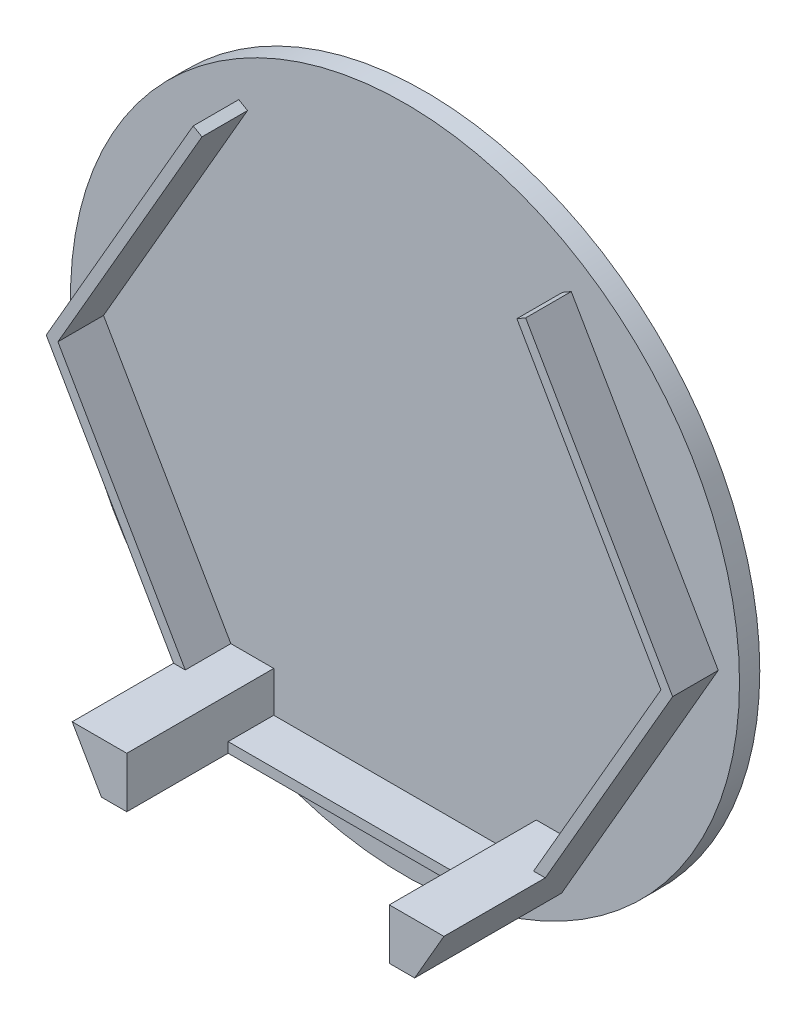
ISO-10303-21;
HEADER;
FILE_DESCRIPTION(('STEP AP214'),'2;1');
FILE_NAME('part.step','',(''),(''),'','','');
FILE_SCHEMA(('AUTOMOTIVE_DESIGN { 1 0 10303 214 1 1 1 1 }'));
ENDSEC;
DATA;
#1=APPLICATION_CONTEXT('core data for automotive mechanical design processes');
#2=APPLICATION_PROTOCOL_DEFINITION('international standard','automotive_design',2000,#1);
#3=PRODUCT_CONTEXT('',#1,'mechanical');
#4=PRODUCT('Part','Part','',(#3));
#5=PRODUCT_RELATED_PRODUCT_CATEGORY('part','',(#4));
#6=PRODUCT_DEFINITION_FORMATION('','',#4);
#7=PRODUCT_DEFINITION_CONTEXT('part definition',#1,'design');
#8=PRODUCT_DEFINITION('design','',#6,#7);
#9=PRODUCT_DEFINITION_SHAPE('','',#8);
#10=(LENGTH_UNIT() NAMED_UNIT(*) SI_UNIT(.MILLI.,.METRE.));
#11=(NAMED_UNIT(*) PLANE_ANGLE_UNIT() SI_UNIT($,.RADIAN.));
#12=(NAMED_UNIT(*) SI_UNIT($,.STERADIAN.) SOLID_ANGLE_UNIT());
#13=UNCERTAINTY_MEASURE_WITH_UNIT(LENGTH_MEASURE(1.E-05),#10,'distance_accuracy_value','');
#14=(GEOMETRIC_REPRESENTATION_CONTEXT(3) GLOBAL_UNCERTAINTY_ASSIGNED_CONTEXT((#13)) GLOBAL_UNIT_ASSIGNED_CONTEXT((#10,
#11,#12)) REPRESENTATION_CONTEXT('',''));
#15=CARTESIAN_POINT('',(0.,0.,0.));
#16=DIRECTION('',(0.,0.,1.));
#17=DIRECTION('',(1.,0.,0.));
#18=AXIS2_PLACEMENT_3D('',#15,#16,#17);
#19=CARTESIAN_POINT('',(0.,0.,6.5));
#20=DIRECTION('',(0.,0.,1.));
#21=DIRECTION('',(1.,0.,0.));
#22=AXIS2_PLACEMENT_3D('',#19,#20,#21);
#23=PLANE('',#22);
#24=DIRECTION('',(-0.5,-0.866025403784439,0.));
#25=VECTOR('',#24,1.);
#26=CARTESIAN_POINT('',(17.1820508075689,-21.7601849769392,6.5));
#27=LINE('',#26,#25);
#28=CARTESIAN_POINT('',(29.7452994616207,0.,6.5));
#29=VERTEX_POINT('',#28);
#30=CARTESIAN_POINT('',(17.1820508075689,-21.7601849769392,6.5));
#31=VERTEX_POINT('',#30);
#32=EDGE_CURVE('E234',#29,#31,#27,.T.);
#33=ORIENTED_EDGE('',*,*,#32,.T.);
#34=DIRECTION('',(-1.,0.,0.));
#35=VECTOR('',#34,1.);
#36=CARTESIAN_POINT('',(18.3367513459481,-21.7601849769392,6.5));
#37=LINE('',#36,#35);
#38=CARTESIAN_POINT('',(18.3367513459481,-21.7601849769392,6.5));
#39=VERTEX_POINT('',#38);
#40=EDGE_CURVE('E200',#39,#31,#37,.T.);
#41=ORIENTED_EDGE('',*,*,#40,.F.);
#42=DIRECTION('',(0.5,0.866025403784439,0.));
#43=VECTOR('',#42,1.);
#44=CARTESIAN_POINT('',(15.45,-26.7601849769392,6.5));
#45=LINE('',#44,#43);
#46=CARTESIAN_POINT('',(30.9,0.,6.5));
#47=VERTEX_POINT('',#46);
#48=EDGE_CURVE('E249',#39,#47,#45,.T.);
#49=ORIENTED_EDGE('',*,*,#48,.T.);
#50=DIRECTION('',(-0.5,0.866025403784439,0.));
#51=VECTOR('',#50,1.);
#52=CARTESIAN_POINT('',(30.9,0.,6.5));
#53=LINE('',#52,#51);
#54=CARTESIAN_POINT('',(16.4,25.1147367097487,6.5));
#55=VERTEX_POINT('',#54);
#56=EDGE_CURVE('E251',#47,#55,#53,.T.);
#57=ORIENTED_EDGE('',*,*,#56,.T.);
#58=DIRECTION('',(-0.866025403784442,-0.499999999999994,0.));
#59=VECTOR('',#58,1.);
#60=CARTESIAN_POINT('',(15.5339745962156,24.6147367097487,6.5));
#61=LINE('',#60,#59);
#62=CARTESIAN_POINT('',(15.5339745962156,24.6147367097487,6.5));
#63=VERTEX_POINT('',#62);
#64=EDGE_CURVE('E228',#55,#63,#61,.T.);
#65=ORIENTED_EDGE('',*,*,#64,.T.);
#66=DIRECTION('',(0.5,-0.866025403784439,0.));
#67=VECTOR('',#66,1.);
#68=CARTESIAN_POINT('',(29.7452994616207,0.,6.5));
#69=LINE('',#68,#67);
#70=EDGE_CURVE('E231',#63,#29,#69,.T.);
#71=ORIENTED_EDGE('',*,*,#70,.T.);
#72=EDGE_LOOP('',(#33,#41,#49,#57,#65,#71));
#73=FACE_BOUND('',#72,.T.);
#74=ADVANCED_FACE('F33',(#73),#23,.T.);
#75=DIRECTION('',(1.,0.,0.));
#76=VECTOR('',#75,1.);
#77=CARTESIAN_POINT('',(-15.45,-26.7601849769392,6.5));
#78=LINE('',#77,#76);
#79=CARTESIAN_POINT('',(-12.95,-26.7601849769392,6.5));
#80=VERTEX_POINT('',#79);
#81=CARTESIAN_POINT('',(12.95,-26.7601849769392,6.5));
#82=VERTEX_POINT('',#81);
#83=EDGE_CURVE('E50',#80,#82,#78,.T.);
#84=ORIENTED_EDGE('',*,*,#83,.T.);
#85=DIRECTION('',(0.,-1.,0.));
#86=VECTOR('',#85,1.);
#87=CARTESIAN_POINT('',(12.95,-21.7601849769392,6.5));
#88=LINE('',#87,#86);
#89=CARTESIAN_POINT('',(12.95,-25.7601849769392,6.5));
#90=VERTEX_POINT('',#89);
#91=EDGE_CURVE('E198',#90,#82,#88,.T.);
#92=ORIENTED_EDGE('',*,*,#91,.F.);
#93=DIRECTION('',(-1.,0.,0.));
#94=VECTOR('',#93,1.);
#95=CARTESIAN_POINT('',(-12.95,-25.7601849769392,6.5));
#96=LINE('',#95,#94);
#97=CARTESIAN_POINT('',(-12.95,-25.7601849769392,6.5));
#98=VERTEX_POINT('',#97);
#99=EDGE_CURVE('E236',#90,#98,#96,.T.);
#100=ORIENTED_EDGE('',*,*,#99,.T.);
#101=DIRECTION('',(0.,1.,0.));
#102=VECTOR('',#101,1.);
#103=CARTESIAN_POINT('',(-12.95,-26.7601849769392,6.5));
#104=LINE('',#103,#102);
#105=EDGE_CURVE('E55',#80,#98,#104,.T.);
#106=ORIENTED_EDGE('',*,*,#105,.F.);
#107=EDGE_LOOP('',(#84,#92,#100,#106));
#108=FACE_BOUND('',#107,.T.);
#109=ADVANCED_FACE('F344',(#108),#23,.T.);
#110=CARTESIAN_POINT('',(0.,0.,2.));
#111=DIRECTION('',(0.,0.,1.));
#112=DIRECTION('',(1.,0.,0.));
#113=AXIS2_PLACEMENT_3D('',#110,#111,#112);
#114=PLANE('',#113);
#115=CARTESIAN_POINT('',(0.,0.,2.));
#116=DIRECTION('',(0.,0.,1.));
#117=DIRECTION('',(1.,0.,0.));
#118=AXIS2_PLACEMENT_3D('',#115,#116,#117);
#119=CIRCLE('',#118,33.);
#120=CARTESIAN_POINT('',(33.,0.,2.));
#121=VERTEX_POINT('',#120);
#122=EDGE_CURVE('E42',#121,#121,#119,.T.);
#123=ORIENTED_EDGE('',*,*,#122,.T.);
#124=EDGE_LOOP('',(#123));
#125=FACE_BOUND('',#124,.T.);
#126=DIRECTION('',(0.5,-0.866025403784439,0.));
#127=VECTOR('',#126,1.);
#128=CARTESIAN_POINT('',(29.7452994616207,0.,2.));
#129=LINE('',#128,#127);
#130=CARTESIAN_POINT('',(15.5339745962156,24.6147367097487,2.));
#131=VERTEX_POINT('',#130);
#132=CARTESIAN_POINT('',(29.7452994616207,0.,2.));
#133=VERTEX_POINT('',#132);
#134=EDGE_CURVE('E256',#131,#133,#129,.T.);
#135=ORIENTED_EDGE('',*,*,#134,.F.);
#136=DIRECTION('',(-0.866025403784442,-0.499999999999994,0.));
#137=VECTOR('',#136,1.);
#138=CARTESIAN_POINT('',(15.5339745962156,24.6147367097487,2.));
#139=LINE('',#138,#137);
#140=CARTESIAN_POINT('',(16.4,25.1147367097487,2.));
#141=VERTEX_POINT('',#140);
#142=EDGE_CURVE('E227',#141,#131,#139,.T.);
#143=ORIENTED_EDGE('',*,*,#142,.F.);
#144=DIRECTION('',(-0.5,0.866025403784439,0.));
#145=VECTOR('',#144,1.);
#146=CARTESIAN_POINT('',(30.9,0.,2.));
#147=LINE('',#146,#145);
#148=CARTESIAN_POINT('',(30.9,0.,2.));
#149=VERTEX_POINT('',#148);
#150=EDGE_CURVE('E232',#149,#141,#147,.T.);
#151=ORIENTED_EDGE('',*,*,#150,.F.);
#152=DIRECTION('',(0.5,0.866025403784439,0.));
#153=VECTOR('',#152,1.);
#154=CARTESIAN_POINT('',(15.45,-26.7601849769392,2.));
#155=LINE('',#154,#153);
#156=CARTESIAN_POINT('',(15.45,-26.7601849769392,2.));
#157=VERTEX_POINT('',#156);
#158=EDGE_CURVE('E281',#157,#149,#155,.T.);
#159=ORIENTED_EDGE('',*,*,#158,.F.);
#160=DIRECTION('',(1.,0.,0.));
#161=VECTOR('',#160,1.);
#162=CARTESIAN_POINT('',(-15.45,-26.7601849769392,2.));
#163=LINE('',#162,#161);
#164=CARTESIAN_POINT('',(-15.45,-26.7601849769392,2.));
#165=VERTEX_POINT('',#164);
#166=EDGE_CURVE('E279',#165,#157,#163,.T.);
#167=ORIENTED_EDGE('',*,*,#166,.F.);
#168=DIRECTION('',(0.5,-0.866025403784438,0.));
#169=VECTOR('',#168,1.);
#170=CARTESIAN_POINT('',(-30.9,0.,2.));
#171=LINE('',#170,#169);
#172=CARTESIAN_POINT('',(-30.9,0.,2.));
#173=VERTEX_POINT('',#172);
#174=EDGE_CURVE('E277',#173,#165,#171,.T.);
#175=ORIENTED_EDGE('',*,*,#174,.F.);
#176=DIRECTION('',(-0.5,-0.866025403784439,0.));
#177=VECTOR('',#176,1.);
#178=CARTESIAN_POINT('',(-16.4,25.1147367097487,2.));
#179=LINE('',#178,#177);
#180=CARTESIAN_POINT('',(-16.4,25.1147367097487,2.));
#181=VERTEX_POINT('',#180);
#182=EDGE_CURVE('E275',#181,#173,#179,.T.);
#183=ORIENTED_EDGE('',*,*,#182,.F.);
#184=DIRECTION('',(-0.866025403784439,0.5,0.));
#185=VECTOR('',#184,1.);
#186=CARTESIAN_POINT('',(-16.4,25.1147367097487,2.));
#187=LINE('',#186,#185);
#188=CARTESIAN_POINT('',(-15.5339745962156,24.6147367097487,2.));
#189=VERTEX_POINT('',#188);
#190=EDGE_CURVE('E273',#189,#181,#187,.T.);
#191=ORIENTED_EDGE('',*,*,#190,.F.);
#192=DIRECTION('',(0.5,0.866025403784439,0.));
#193=VECTOR('',#192,1.);
#194=CARTESIAN_POINT('',(-15.5339745962156,24.6147367097487,2.));
#195=LINE('',#194,#193);
#196=CARTESIAN_POINT('',(-29.7452994616207,0.,2.));
#197=VERTEX_POINT('',#196);
#198=EDGE_CURVE('E271',#197,#189,#195,.T.);
#199=ORIENTED_EDGE('',*,*,#198,.F.);
#200=DIRECTION('',(-0.5,0.866025403784438,0.));
#201=VECTOR('',#200,1.);
#202=CARTESIAN_POINT('',(-29.7452994616207,0.,2.));
#203=LINE('',#202,#201);
#204=CARTESIAN_POINT('',(-17.1820508075689,-21.7601849769392,2.));
#205=VERTEX_POINT('',#204);
#206=EDGE_CURVE('E269',#205,#197,#203,.T.);
#207=ORIENTED_EDGE('',*,*,#206,.F.);
#208=DIRECTION('',(-1.,0.,0.));
#209=VECTOR('',#208,1.);
#210=CARTESIAN_POINT('',(-12.95,-21.7601849769392,2.));
#211=LINE('',#210,#209);
#212=CARTESIAN_POINT('',(-12.95,-21.7601849769392,2.));
#213=VERTEX_POINT('',#212);
#214=EDGE_CURVE('E267',#213,#205,#211,.T.);
#215=ORIENTED_EDGE('',*,*,#214,.F.);
#216=DIRECTION('',(0.,1.,0.));
#217=VECTOR('',#216,1.);
#218=CARTESIAN_POINT('',(-12.95,-25.7601849769392,2.));
#219=LINE('',#218,#217);
#220=CARTESIAN_POINT('',(-12.95,-25.7601849769392,2.));
#221=VERTEX_POINT('',#220);
#222=EDGE_CURVE('E265',#221,#213,#219,.T.);
#223=ORIENTED_EDGE('',*,*,#222,.F.);
#224=DIRECTION('',(-1.,0.,0.));
#225=VECTOR('',#224,1.);
#226=CARTESIAN_POINT('',(-12.95,-25.7601849769392,2.));
#227=LINE('',#226,#225);
#228=CARTESIAN_POINT('',(12.95,-25.7601849769392,2.));
#229=VERTEX_POINT('',#228);
#230=EDGE_CURVE('E263',#229,#221,#227,.T.);
#231=ORIENTED_EDGE('',*,*,#230,.F.);
#232=DIRECTION('',(0.,-1.,0.));
#233=VECTOR('',#232,1.);
#234=CARTESIAN_POINT('',(12.95,-25.7601849769392,2.));
#235=LINE('',#234,#233);
#236=CARTESIAN_POINT('',(12.95,-21.7601849769392,2.));
#237=VERTEX_POINT('',#236);
#238=EDGE_CURVE('E261',#237,#229,#235,.T.);
#239=ORIENTED_EDGE('',*,*,#238,.F.);
#240=DIRECTION('',(-1.,0.,0.));
#241=VECTOR('',#240,1.);
#242=CARTESIAN_POINT('',(12.95,-21.7601849769392,2.));
#243=LINE('',#242,#241);
#244=CARTESIAN_POINT('',(17.1820508075689,-21.7601849769392,2.));
#245=VERTEX_POINT('',#244);
#246=EDGE_CURVE('E178',#245,#237,#243,.T.);
#247=ORIENTED_EDGE('',*,*,#246,.F.);
#248=DIRECTION('',(-0.5,-0.866025403784439,0.));
#249=VECTOR('',#248,1.);
#250=CARTESIAN_POINT('',(17.1820508075689,-21.7601849769392,2.));
#251=LINE('',#250,#249);
#252=EDGE_CURVE('E258',#133,#245,#251,.T.);
#253=ORIENTED_EDGE('',*,*,#252,.F.);
#254=EDGE_LOOP('',(#135,#143,#151,#159,#167,#175,#183,#191,#199,#207,#215,#223,#231,#239,#247,#253));
#255=FACE_BOUND('',#254,.T.);
#256=ADVANCED_FACE('F340',(#125,#255),#114,.T.);
#257=CARTESIAN_POINT('',(0.,0.,2.));
#258=DIRECTION('',(0.,0.,-1.));
#259=DIRECTION('',(-1.,0.,0.));
#260=AXIS2_PLACEMENT_3D('',#257,#258,#259);
#261=CYLINDRICAL_SURFACE('',#260,33.);
#262=ORIENTED_EDGE('',*,*,#122,.F.);
#263=EDGE_LOOP('',(#262));
#264=FACE_BOUND('',#263,.T.);
#265=CARTESIAN_POINT('',(0.,0.,0.));
#266=DIRECTION('',(0.,0.,1.));
#267=DIRECTION('',(1.,0.,0.));
#268=AXIS2_PLACEMENT_3D('',#265,#266,#267);
#269=CIRCLE('',#268,33.);
#270=CARTESIAN_POINT('',(33.,0.,0.));
#271=VERTEX_POINT('',#270);
#272=EDGE_CURVE('E37',#271,#271,#269,.T.);
#273=ORIENTED_EDGE('',*,*,#272,.T.);
#274=EDGE_LOOP('',(#273));
#275=FACE_BOUND('',#274,.T.);
#276=ADVANCED_FACE('F35',(#264,#275),#261,.T.);
#277=CARTESIAN_POINT('',(0.,0.,0.));
#278=DIRECTION('',(0.,0.,1.));
#279=DIRECTION('',(1.,0.,0.));
#280=AXIS2_PLACEMENT_3D('',#277,#278,#279);
#281=PLANE('',#280);
#282=ORIENTED_EDGE('',*,*,#272,.F.);
#283=EDGE_LOOP('',(#282));
#284=FACE_BOUND('',#283,.T.);
#285=ADVANCED_FACE('F330',(#284),#281,.F.);
#286=CARTESIAN_POINT('',(15.5339745962156,24.6147367097487,6.5));
#287=DIRECTION('',(0.499999999999994,-0.866025403784442,0.));
#288=DIRECTION('',(0.866025403784442,0.499999999999994,0.));
#289=AXIS2_PLACEMENT_3D('',#286,#287,#288);
#290=PLANE('',#289);
#291=ORIENTED_EDGE('',*,*,#142,.T.);
#292=DIRECTION('',(0.,0.,-1.));
#293=VECTOR('',#292,1.);
#294=CARTESIAN_POINT('',(15.5339745962156,24.6147367097487,6.5));
#295=LINE('',#294,#293);
#296=EDGE_CURVE('E322',#63,#131,#295,.T.);
#297=ORIENTED_EDGE('',*,*,#296,.F.);
#298=ORIENTED_EDGE('',*,*,#64,.F.);
#299=DIRECTION('',(0.,0.,-1.));
#300=VECTOR('',#299,1.);
#301=CARTESIAN_POINT('',(16.4,25.1147367097487,6.5));
#302=LINE('',#301,#300);
#303=EDGE_CURVE('E253',#55,#141,#302,.T.);
#304=ORIENTED_EDGE('',*,*,#303,.T.);
#305=EDGE_LOOP('',(#291,#297,#298,#304));
#306=FACE_BOUND('',#305,.T.);
#307=ADVANCED_FACE('F332',(#306),#290,.F.);
#308=CARTESIAN_POINT('',(29.7452994616207,0.,6.5));
#309=DIRECTION('',(0.866025403784439,0.5,0.));
#310=DIRECTION('',(-0.5,0.866025403784439,0.));
#311=AXIS2_PLACEMENT_3D('',#308,#309,#310);
#312=PLANE('',#311);
#313=ORIENTED_EDGE('',*,*,#134,.T.);
#314=DIRECTION('',(0.,0.,-1.));
#315=VECTOR('',#314,1.);
#316=CARTESIAN_POINT('',(29.7452994616207,0.,6.5));
#317=LINE('',#316,#315);
#318=EDGE_CURVE('E319',#29,#133,#317,.T.);
#319=ORIENTED_EDGE('',*,*,#318,.F.);
#320=ORIENTED_EDGE('',*,*,#70,.F.);
#321=ORIENTED_EDGE('',*,*,#296,.T.);
#322=EDGE_LOOP('',(#313,#319,#320,#321));
#323=FACE_BOUND('',#322,.T.);
#324=ADVANCED_FACE('F337',(#323),#312,.F.);
#325=CARTESIAN_POINT('',(17.1820508075689,-21.7601849769392,6.5));
#326=DIRECTION('',(0.866025403784439,-0.5,0.));
#327=DIRECTION('',(0.5,0.866025403784439,0.));
#328=AXIS2_PLACEMENT_3D('',#325,#326,#327);
#329=PLANE('',#328);
#330=ORIENTED_EDGE('',*,*,#252,.T.);
#331=DIRECTION('',(0.,0.,-1.));
#332=VECTOR('',#331,1.);
#333=CARTESIAN_POINT('',(17.1820508075689,-21.7601849769392,6.5));
#334=LINE('',#333,#332);
#335=EDGE_CURVE('E181',#31,#245,#334,.T.);
#336=ORIENTED_EDGE('',*,*,#335,.F.);
#337=ORIENTED_EDGE('',*,*,#32,.F.);
#338=ORIENTED_EDGE('',*,*,#318,.T.);
#339=EDGE_LOOP('',(#330,#336,#337,#338));
#340=FACE_BOUND('',#339,.T.);
#341=ADVANCED_FACE('F416',(#340),#329,.F.);
#342=CARTESIAN_POINT('',(12.95,-21.7601849769392,6.5));
#343=DIRECTION('',(0.,-1.,0.));
#344=DIRECTION('',(0.,0.,-1.));
#345=AXIS2_PLACEMENT_3D('',#342,#343,#344);
#346=PLANE('',#345);
#347=ORIENTED_EDGE('',*,*,#246,.T.);
#348=DIRECTION('',(0.,0.,-1.));
#349=VECTOR('',#348,1.);
#350=CARTESIAN_POINT('',(12.95,-21.7601849769392,6.5));
#351=LINE('',#350,#349);
#352=CARTESIAN_POINT('',(12.95,-21.7601849769392,16.5));
#353=VERTEX_POINT('',#352);
#354=EDGE_CURVE('E170',#353,#237,#351,.T.);
#355=ORIENTED_EDGE('',*,*,#354,.F.);
#356=DIRECTION('',(-1.,0.,0.));
#357=VECTOR('',#356,1.);
#358=CARTESIAN_POINT('',(18.3367513459481,-21.7601849769392,16.5));
#359=LINE('',#358,#357);
#360=CARTESIAN_POINT('',(18.3367513459481,-21.7601849769392,16.5));
#361=VERTEX_POINT('',#360);
#362=EDGE_CURVE('E175',#361,#353,#359,.T.);
#363=ORIENTED_EDGE('',*,*,#362,.F.);
#364=DIRECTION('',(0.,0.,-1.));
#365=VECTOR('',#364,1.);
#366=CARTESIAN_POINT('',(18.3367513459481,-21.7601849769392,16.5));
#367=LINE('',#366,#365);
#368=EDGE_CURVE('E205',#361,#39,#367,.T.);
#369=ORIENTED_EDGE('',*,*,#368,.T.);
#370=ORIENTED_EDGE('',*,*,#40,.T.);
#371=ORIENTED_EDGE('',*,*,#335,.T.);
#372=EDGE_LOOP('',(#347,#355,#363,#369,#370,#371));
#373=FACE_BOUND('',#372,.T.);
#374=ADVANCED_FACE('F172',(#373),#346,.F.);
#375=CARTESIAN_POINT('',(12.95,-25.7601849769392,6.5));
#376=DIRECTION('',(1.,0.,0.));
#377=DIRECTION('',(0.,1.,0.));
#378=AXIS2_PLACEMENT_3D('',#375,#376,#377);
#379=PLANE('',#378);
#380=ORIENTED_EDGE('',*,*,#238,.T.);
#381=DIRECTION('',(0.,0.,-1.));
#382=VECTOR('',#381,1.);
#383=CARTESIAN_POINT('',(12.95,-25.7601849769392,6.5));
#384=LINE('',#383,#382);
#385=EDGE_CURVE('E182',#90,#229,#384,.T.);
#386=ORIENTED_EDGE('',*,*,#385,.F.);
#387=ORIENTED_EDGE('',*,*,#91,.T.);
#388=DIRECTION('',(0.,0.,-1.));
#389=VECTOR('',#388,1.);
#390=CARTESIAN_POINT('',(12.95,-26.7601849769392,16.5));
#391=LINE('',#390,#389);
#392=CARTESIAN_POINT('',(12.95,-26.7601849769392,16.5));
#393=VERTEX_POINT('',#392);
#394=EDGE_CURVE('E188',#393,#82,#391,.T.);
#395=ORIENTED_EDGE('',*,*,#394,.F.);
#396=DIRECTION('',(0.,-1.,0.));
#397=VECTOR('',#396,1.);
#398=CARTESIAN_POINT('',(12.95,-21.7601849769392,16.5));
#399=LINE('',#398,#397);
#400=EDGE_CURVE('E185',#353,#393,#399,.T.);
#401=ORIENTED_EDGE('',*,*,#400,.F.);
#402=ORIENTED_EDGE('',*,*,#354,.T.);
#403=EDGE_LOOP('',(#380,#386,#387,#395,#401,#402));
#404=FACE_BOUND('',#403,.T.);
#405=ADVANCED_FACE('F186',(#404),#379,.F.);
#406=CARTESIAN_POINT('',(-12.95,-25.7601849769392,6.5));
#407=DIRECTION('',(0.,-1.,0.));
#408=DIRECTION('',(0.,0.,-1.));
#409=AXIS2_PLACEMENT_3D('',#406,#407,#408);
#410=PLANE('',#409);
#411=ORIENTED_EDGE('',*,*,#230,.T.);
#412=DIRECTION('',(0.,0.,-1.));
#413=VECTOR('',#412,1.);
#414=CARTESIAN_POINT('',(-12.95,-25.7601849769392,6.5));
#415=LINE('',#414,#413);
#416=EDGE_CURVE('E313',#98,#221,#415,.T.);
#417=ORIENTED_EDGE('',*,*,#416,.F.);
#418=ORIENTED_EDGE('',*,*,#99,.F.);
#419=ORIENTED_EDGE('',*,*,#385,.T.);
#420=EDGE_LOOP('',(#411,#417,#418,#419));
#421=FACE_BOUND('',#420,.T.);
#422=ADVANCED_FACE('F422',(#421),#410,.F.);
#423=CARTESIAN_POINT('',(-12.95,-25.7601849769392,6.5));
#424=DIRECTION('',(-1.,0.,0.));
#425=DIRECTION('',(0.,0.,1.));
#426=AXIS2_PLACEMENT_3D('',#423,#424,#425);
#427=PLANE('',#426);
#428=ORIENTED_EDGE('',*,*,#222,.T.);
#429=DIRECTION('',(0.,0.,-1.));
#430=VECTOR('',#429,1.);
#431=CARTESIAN_POINT('',(-12.95,-21.7601849769392,6.5));
#432=LINE('',#431,#430);
#433=CARTESIAN_POINT('',(-12.95,-21.7601849769392,16.5));
#434=VERTEX_POINT('',#433);
#435=EDGE_CURVE('E310',#434,#213,#432,.T.);
#436=ORIENTED_EDGE('',*,*,#435,.F.);
#437=DIRECTION('',(0.,1.,0.));
#438=VECTOR('',#437,1.);
#439=CARTESIAN_POINT('',(-12.95,-26.7601849769392,16.5));
#440=LINE('',#439,#438);
#441=CARTESIAN_POINT('',(-12.95,-26.7601849769392,16.5));
#442=VERTEX_POINT('',#441);
#443=EDGE_CURVE('E210',#442,#434,#440,.T.);
#444=ORIENTED_EDGE('',*,*,#443,.F.);
#445=DIRECTION('',(0.,0.,-1.));
#446=VECTOR('',#445,1.);
#447=CARTESIAN_POINT('',(-12.95,-26.7601849769392,16.5));
#448=LINE('',#447,#446);
#449=EDGE_CURVE('E220',#442,#80,#448,.T.);
#450=ORIENTED_EDGE('',*,*,#449,.T.);
#451=ORIENTED_EDGE('',*,*,#105,.T.);
#452=ORIENTED_EDGE('',*,*,#416,.T.);
#453=EDGE_LOOP('',(#428,#436,#444,#450,#451,#452));
#454=FACE_BOUND('',#453,.T.);
#455=ADVANCED_FACE('F399',(#454),#427,.F.);
#456=CARTESIAN_POINT('',(-12.95,-21.7601849769392,6.5));
#457=DIRECTION('',(0.,-1.,0.));
#458=DIRECTION('',(0.,0.,-1.));
#459=AXIS2_PLACEMENT_3D('',#456,#457,#458);
#460=PLANE('',#459);
#461=ORIENTED_EDGE('',*,*,#214,.T.);
#462=DIRECTION('',(0.,0.,-1.));
#463=VECTOR('',#462,1.);
#464=CARTESIAN_POINT('',(-17.1820508075689,-21.7601849769392,6.5));
#465=LINE('',#464,#463);
#466=CARTESIAN_POINT('',(-17.1820508075689,-21.7601849769392,6.5));
#467=VERTEX_POINT('',#466);
#468=EDGE_CURVE('E307',#467,#205,#465,.T.);
#469=ORIENTED_EDGE('',*,*,#468,.F.);
#470=DIRECTION('',(-1.,0.,0.));
#471=VECTOR('',#470,1.);
#472=CARTESIAN_POINT('',(-12.95,-21.7601849769392,6.5));
#473=LINE('',#472,#471);
#474=CARTESIAN_POINT('',(-18.3367513459481,-21.7601849769392,6.5));
#475=VERTEX_POINT('',#474);
#476=EDGE_CURVE('E11',#467,#475,#473,.T.);
#477=ORIENTED_EDGE('',*,*,#476,.T.);
#478=DIRECTION('',(0.,0.,-1.));
#479=VECTOR('',#478,1.);
#480=CARTESIAN_POINT('',(-18.3367513459481,-21.7601849769392,16.5));
#481=LINE('',#480,#479);
#482=CARTESIAN_POINT('',(-18.3367513459481,-21.7601849769392,16.5));
#483=VERTEX_POINT('',#482);
#484=EDGE_CURVE('E224',#483,#475,#481,.T.);
#485=ORIENTED_EDGE('',*,*,#484,.F.);
#486=DIRECTION('',(-1.,0.,0.));
#487=VECTOR('',#486,1.);
#488=CARTESIAN_POINT('',(-12.95,-21.7601849769392,16.5));
#489=LINE('',#488,#487);
#490=EDGE_CURVE('E213',#434,#483,#489,.T.);
#491=ORIENTED_EDGE('',*,*,#490,.F.);
#492=ORIENTED_EDGE('',*,*,#435,.T.);
#493=EDGE_LOOP('',(#461,#469,#477,#485,#491,#492));
#494=FACE_BOUND('',#493,.T.);
#495=ADVANCED_FACE('F370',(#494),#460,.F.);
#496=CARTESIAN_POINT('',(-29.7452994616207,0.,6.5));
#497=DIRECTION('',(-0.866025403784439,-0.5,0.));
#498=DIRECTION('',(0.5,-0.866025403784439,0.));
#499=AXIS2_PLACEMENT_3D('',#496,#497,#498);
#500=PLANE('',#499);
#501=ORIENTED_EDGE('',*,*,#206,.T.);
#502=DIRECTION('',(0.,0.,-1.));
#503=VECTOR('',#502,1.);
#504=CARTESIAN_POINT('',(-29.7452994616207,0.,6.5));
#505=LINE('',#504,#503);
#506=CARTESIAN_POINT('',(-29.7452994616207,0.,6.5));
#507=VERTEX_POINT('',#506);
#508=EDGE_CURVE('E304',#507,#197,#505,.T.);
#509=ORIENTED_EDGE('',*,*,#508,.F.);
#510=DIRECTION('',(-0.5,0.866025403784438,0.));
#511=VECTOR('',#510,1.);
#512=CARTESIAN_POINT('',(-29.7452994616207,0.,6.5));
#513=LINE('',#512,#511);
#514=EDGE_CURVE('E238',#467,#507,#513,.T.);
#515=ORIENTED_EDGE('',*,*,#514,.F.);
#516=ORIENTED_EDGE('',*,*,#468,.T.);
#517=EDGE_LOOP('',(#501,#509,#515,#516));
#518=FACE_BOUND('',#517,.T.);
#519=ADVANCED_FACE('F374',(#518),#500,.F.);
#520=CARTESIAN_POINT('',(-15.5339745962156,24.6147367097487,6.5));
#521=DIRECTION('',(-0.866025403784439,0.5,0.));
#522=DIRECTION('',(-0.5,-0.866025403784439,0.));
#523=AXIS2_PLACEMENT_3D('',#520,#521,#522);
#524=PLANE('',#523);
#525=ORIENTED_EDGE('',*,*,#198,.T.);
#526=DIRECTION('',(0.,0.,-1.));
#527=VECTOR('',#526,1.);
#528=CARTESIAN_POINT('',(-15.5339745962156,24.6147367097487,6.5));
#529=LINE('',#528,#527);
#530=CARTESIAN_POINT('',(-15.5339745962156,24.6147367097487,6.5));
#531=VERTEX_POINT('',#530);
#532=EDGE_CURVE('E301',#531,#189,#529,.T.);
#533=ORIENTED_EDGE('',*,*,#532,.F.);
#534=DIRECTION('',(0.5,0.866025403784439,0.));
#535=VECTOR('',#534,1.);
#536=CARTESIAN_POINT('',(-15.5339745962156,24.6147367097487,6.5));
#537=LINE('',#536,#535);
#538=EDGE_CURVE('E240',#507,#531,#537,.T.);
#539=ORIENTED_EDGE('',*,*,#538,.F.);
#540=ORIENTED_EDGE('',*,*,#508,.T.);
#541=EDGE_LOOP('',(#525,#533,#539,#540));
#542=FACE_BOUND('',#541,.T.);
#543=ADVANCED_FACE('F379',(#542),#524,.F.);
#544=CARTESIAN_POINT('',(-16.4,25.1147367097487,6.5));
#545=DIRECTION('',(-0.5,-0.866025403784439,0.));
#546=DIRECTION('',(0.866025403784439,-0.5,0.));
#547=AXIS2_PLACEMENT_3D('',#544,#545,#546);
#548=PLANE('',#547);
#549=ORIENTED_EDGE('',*,*,#190,.T.);
#550=DIRECTION('',(0.,0.,-1.));
#551=VECTOR('',#550,1.);
#552=CARTESIAN_POINT('',(-16.4,25.1147367097487,6.5));
#553=LINE('',#552,#551);
#554=CARTESIAN_POINT('',(-16.4,25.1147367097487,6.5));
#555=VERTEX_POINT('',#554);
#556=EDGE_CURVE('E298',#555,#181,#553,.T.);
#557=ORIENTED_EDGE('',*,*,#556,.F.);
#558=DIRECTION('',(-0.866025403784439,0.5,0.));
#559=VECTOR('',#558,1.);
#560=CARTESIAN_POINT('',(-16.4,25.1147367097487,6.5));
#561=LINE('',#560,#559);
#562=EDGE_CURVE('E242',#531,#555,#561,.T.);
#563=ORIENTED_EDGE('',*,*,#562,.F.);
#564=ORIENTED_EDGE('',*,*,#532,.T.);
#565=EDGE_LOOP('',(#549,#557,#563,#564));
#566=FACE_BOUND('',#565,.T.);
#567=ADVANCED_FACE('F385',(#566),#548,.F.);
#568=CARTESIAN_POINT('',(-16.4,25.1147367097487,6.5));
#569=DIRECTION('',(0.866025403784439,-0.5,0.));
#570=DIRECTION('',(0.5,0.866025403784439,0.));
#571=AXIS2_PLACEMENT_3D('',#568,#569,#570);
#572=PLANE('',#571);
#573=ORIENTED_EDGE('',*,*,#182,.T.);
#574=DIRECTION('',(0.,0.,-1.));
#575=VECTOR('',#574,1.);
#576=CARTESIAN_POINT('',(-30.9,0.,6.5));
#577=LINE('',#576,#575);
#578=CARTESIAN_POINT('',(-30.9,0.,6.5));
#579=VERTEX_POINT('',#578);
#580=EDGE_CURVE('E295',#579,#173,#577,.T.);
#581=ORIENTED_EDGE('',*,*,#580,.F.);
#582=DIRECTION('',(-0.5,-0.866025403784439,0.));
#583=VECTOR('',#582,1.);
#584=CARTESIAN_POINT('',(-16.4,25.1147367097487,6.5));
#585=LINE('',#584,#583);
#586=EDGE_CURVE('E244',#555,#579,#585,.T.);
#587=ORIENTED_EDGE('',*,*,#586,.F.);
#588=ORIENTED_EDGE('',*,*,#556,.T.);
#589=EDGE_LOOP('',(#573,#581,#587,#588));
#590=FACE_BOUND('',#589,.T.);
#591=ADVANCED_FACE('F389',(#590),#572,.F.);
#592=CARTESIAN_POINT('',(-30.9,0.,6.5));
#593=DIRECTION('',(0.866025403784438,0.5,0.));
#594=DIRECTION('',(-0.5,0.866025403784439,0.));
#595=AXIS2_PLACEMENT_3D('',#592,#593,#594);
#596=PLANE('',#595);
#597=ORIENTED_EDGE('',*,*,#174,.T.);
#598=DIRECTION('',(0.,0.,-1.));
#599=VECTOR('',#598,1.);
#600=CARTESIAN_POINT('',(-15.45,-26.7601849769392,6.5));
#601=LINE('',#600,#599);
#602=CARTESIAN_POINT('',(-15.45,-26.7601849769392,16.5));
#603=VERTEX_POINT('',#602);
#604=EDGE_CURVE('E292',#603,#165,#601,.T.);
#605=ORIENTED_EDGE('',*,*,#604,.F.);
#606=DIRECTION('',(0.5,-0.866025403784439,0.));
#607=VECTOR('',#606,1.);
#608=CARTESIAN_POINT('',(-18.3367513459481,-21.7601849769392,16.5));
#609=LINE('',#608,#607);
#610=EDGE_CURVE('E215',#483,#603,#609,.T.);
#611=ORIENTED_EDGE('',*,*,#610,.F.);
#612=ORIENTED_EDGE('',*,*,#484,.T.);
#613=DIRECTION('',(0.5,-0.866025403784438,0.));
#614=VECTOR('',#613,1.);
#615=CARTESIAN_POINT('',(-30.9,0.,6.5));
#616=LINE('',#615,#614);
#617=EDGE_CURVE('E246',#579,#475,#616,.T.);
#618=ORIENTED_EDGE('',*,*,#617,.F.);
#619=ORIENTED_EDGE('',*,*,#580,.T.);
#620=EDGE_LOOP('',(#597,#605,#611,#612,#618,#619));
#621=FACE_BOUND('',#620,.T.);
#622=ADVANCED_FACE('F392',(#621),#596,.F.);
#623=CARTESIAN_POINT('',(-15.45,-26.7601849769392,6.5));
#624=DIRECTION('',(0.,1.,0.));
#625=DIRECTION('',(0.,0.,1.));
#626=AXIS2_PLACEMENT_3D('',#623,#624,#625);
#627=PLANE('',#626);
#628=ORIENTED_EDGE('',*,*,#166,.T.);
#629=DIRECTION('',(0.,0.,-1.));
#630=VECTOR('',#629,1.);
#631=CARTESIAN_POINT('',(15.45,-26.7601849769392,6.5));
#632=LINE('',#631,#630);
#633=CARTESIAN_POINT('',(15.45,-26.7601849769392,16.5));
#634=VERTEX_POINT('',#633);
#635=EDGE_CURVE('E289',#634,#157,#632,.T.);
#636=ORIENTED_EDGE('',*,*,#635,.F.);
#637=DIRECTION('',(1.,0.,0.));
#638=VECTOR('',#637,1.);
#639=CARTESIAN_POINT('',(12.95,-26.7601849769392,16.5));
#640=LINE('',#639,#638);
#641=EDGE_CURVE('E192',#393,#634,#640,.T.);
#642=ORIENTED_EDGE('',*,*,#641,.F.);
#643=ORIENTED_EDGE('',*,*,#394,.T.);
#644=ORIENTED_EDGE('',*,*,#83,.F.);
#645=ORIENTED_EDGE('',*,*,#449,.F.);
#646=DIRECTION('',(1.,0.,0.));
#647=VECTOR('',#646,1.);
#648=CARTESIAN_POINT('',(-15.45,-26.7601849769392,16.5));
#649=LINE('',#648,#647);
#650=EDGE_CURVE('E218',#603,#442,#649,.T.);
#651=ORIENTED_EDGE('',*,*,#650,.F.);
#652=ORIENTED_EDGE('',*,*,#604,.T.);
#653=EDGE_LOOP('',(#628,#636,#642,#643,#644,#645,#651,#652));
#654=FACE_BOUND('',#653,.T.);
#655=ADVANCED_FACE('F408',(#654),#627,.F.);
#656=CARTESIAN_POINT('',(15.45,-26.7601849769392,6.5));
#657=DIRECTION('',(-0.866025403784439,0.5,0.));
#658=DIRECTION('',(-0.5,-0.866025403784439,0.));
#659=AXIS2_PLACEMENT_3D('',#656,#657,#658);
#660=PLANE('',#659);
#661=ORIENTED_EDGE('',*,*,#158,.T.);
#662=DIRECTION('',(0.,0.,-1.));
#663=VECTOR('',#662,1.);
#664=CARTESIAN_POINT('',(30.9,0.,6.5));
#665=LINE('',#664,#663);
#666=EDGE_CURVE('E287',#47,#149,#665,.T.);
#667=ORIENTED_EDGE('',*,*,#666,.F.);
#668=ORIENTED_EDGE('',*,*,#48,.F.);
#669=ORIENTED_EDGE('',*,*,#368,.F.);
#670=DIRECTION('',(0.5,0.866025403784439,0.));
#671=VECTOR('',#670,1.);
#672=CARTESIAN_POINT('',(15.45,-26.7601849769392,16.5));
#673=LINE('',#672,#671);
#674=EDGE_CURVE('E196',#634,#361,#673,.T.);
#675=ORIENTED_EDGE('',*,*,#674,.F.);
#676=ORIENTED_EDGE('',*,*,#635,.T.);
#677=EDGE_LOOP('',(#661,#667,#668,#669,#675,#676));
#678=FACE_BOUND('',#677,.T.);
#679=ADVANCED_FACE('F362',(#678),#660,.F.);
#680=CARTESIAN_POINT('',(30.9,0.,6.5));
#681=DIRECTION('',(-0.866025403784439,-0.5,0.));
#682=DIRECTION('',(0.5,-0.866025403784439,0.));
#683=AXIS2_PLACEMENT_3D('',#680,#681,#682);
#684=PLANE('',#683);
#685=ORIENTED_EDGE('',*,*,#150,.T.);
#686=ORIENTED_EDGE('',*,*,#303,.F.);
#687=ORIENTED_EDGE('',*,*,#56,.F.);
#688=ORIENTED_EDGE('',*,*,#666,.T.);
#689=EDGE_LOOP('',(#685,#686,#687,#688));
#690=FACE_BOUND('',#689,.T.);
#691=ADVANCED_FACE('F355',(#690),#684,.F.);
#692=ORIENTED_EDGE('',*,*,#476,.F.);
#693=ORIENTED_EDGE('',*,*,#514,.T.);
#694=ORIENTED_EDGE('',*,*,#538,.T.);
#695=ORIENTED_EDGE('',*,*,#562,.T.);
#696=ORIENTED_EDGE('',*,*,#586,.T.);
#697=ORIENTED_EDGE('',*,*,#617,.T.);
#698=EDGE_LOOP('',(#692,#693,#694,#695,#696,#697));
#699=FACE_BOUND('',#698,.T.);
#700=ADVANCED_FACE('F347',(#699),#23,.T.);
#701=CARTESIAN_POINT('',(0.,0.,16.5));
#702=DIRECTION('',(0.,0.,1.));
#703=DIRECTION('',(1.,0.,0.));
#704=AXIS2_PLACEMENT_3D('',#701,#702,#703);
#705=PLANE('',#704);
#706=ORIENTED_EDGE('',*,*,#443,.T.);
#707=ORIENTED_EDGE('',*,*,#490,.T.);
#708=ORIENTED_EDGE('',*,*,#610,.T.);
#709=ORIENTED_EDGE('',*,*,#650,.T.);
#710=EDGE_LOOP('',(#706,#707,#708,#709));
#711=FACE_BOUND('',#710,.T.);
#712=ADVANCED_FACE('F354',(#711),#705,.T.);
#713=CARTESIAN_POINT('',(0.,0.,16.5));
#714=DIRECTION('',(0.,0.,1.));
#715=DIRECTION('',(1.,0.,0.));
#716=AXIS2_PLACEMENT_3D('',#713,#714,#715);
#717=PLANE('',#716);
#718=ORIENTED_EDGE('',*,*,#362,.T.);
#719=ORIENTED_EDGE('',*,*,#400,.T.);
#720=ORIENTED_EDGE('',*,*,#641,.T.);
#721=ORIENTED_EDGE('',*,*,#674,.T.);
#722=EDGE_LOOP('',(#718,#719,#720,#721));
#723=FACE_BOUND('',#722,.T.);
#724=ADVANCED_FACE('F194',(#723),#717,.T.);
#725=CLOSED_SHELL('',(#74,#109,#256,#276,#285,#307,#324,#341,#374,#405,#422,#455,#495,#519,#543,
#567,#591,#622,#655,#679,#691,#700,#712,#724));
#726=MANIFOLD_SOLID_BREP('B2',#725);
#727=ADVANCED_BREP_SHAPE_REPRESENTATION('',(#18,#726),#14);
#728=SHAPE_DEFINITION_REPRESENTATION(#9,#727);
ENDSEC;
END-ISO-10303-21;
